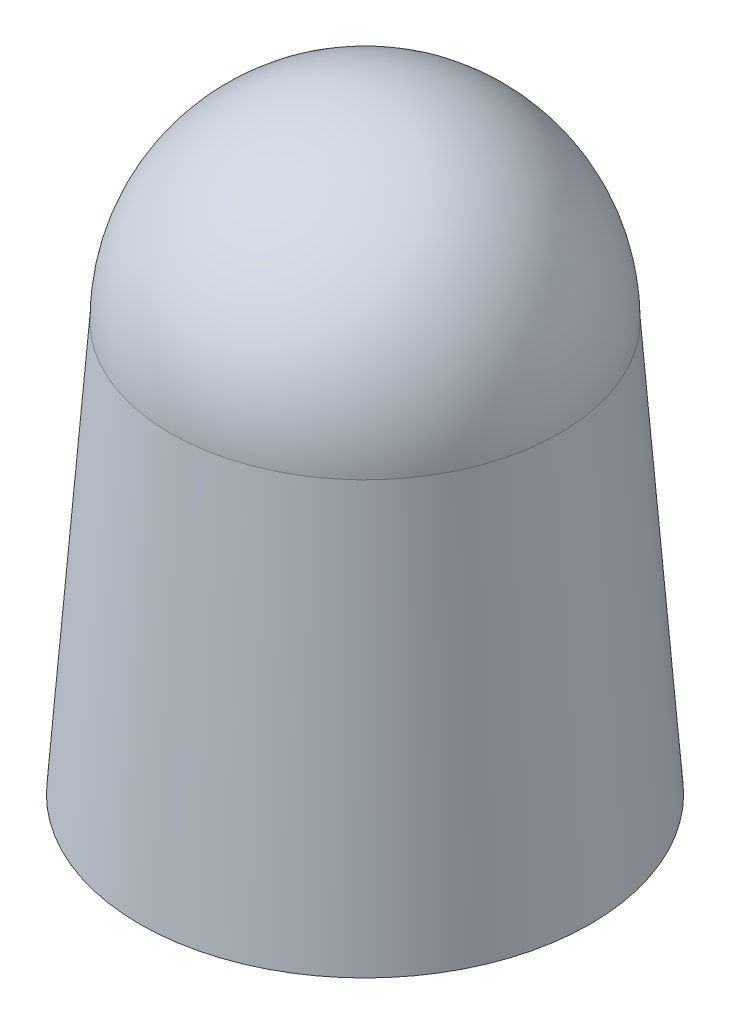
ISO-10303-21;
HEADER;
FILE_DESCRIPTION(('STEP AP214'),'2;1');
FILE_NAME('part.step','',(''),(''),'','','');
FILE_SCHEMA(('AUTOMOTIVE_DESIGN { 1 0 10303 214 1 1 1 1 }'));
ENDSEC;
DATA;
#1=APPLICATION_CONTEXT('core data for automotive mechanical design processes');
#2=APPLICATION_PROTOCOL_DEFINITION('international standard','automotive_design',2000,#1);
#3=PRODUCT_CONTEXT('',#1,'mechanical');
#4=PRODUCT('Part','Part','',(#3));
#5=PRODUCT_RELATED_PRODUCT_CATEGORY('part','',(#4));
#6=PRODUCT_DEFINITION_FORMATION('','',#4);
#7=PRODUCT_DEFINITION_CONTEXT('part definition',#1,'design');
#8=PRODUCT_DEFINITION('design','',#6,#7);
#9=PRODUCT_DEFINITION_SHAPE('','',#8);
#10=(LENGTH_UNIT() NAMED_UNIT(*) SI_UNIT(.MILLI.,.METRE.));
#11=(NAMED_UNIT(*) PLANE_ANGLE_UNIT() SI_UNIT($,.RADIAN.));
#12=(NAMED_UNIT(*) SI_UNIT($,.STERADIAN.) SOLID_ANGLE_UNIT());
#13=UNCERTAINTY_MEASURE_WITH_UNIT(LENGTH_MEASURE(1.E-05),#10,'distance_accuracy_value','');
#14=(GEOMETRIC_REPRESENTATION_CONTEXT(3) GLOBAL_UNCERTAINTY_ASSIGNED_CONTEXT((#13)) GLOBAL_UNIT_ASSIGNED_CONTEXT((#10,
#11,#12)) REPRESENTATION_CONTEXT('',''));
#15=CARTESIAN_POINT('',(0.,0.,0.));
#16=DIRECTION('',(0.,0.,1.));
#17=DIRECTION('',(1.,0.,0.));
#18=AXIS2_PLACEMENT_3D('',#15,#16,#17);
#19=CARTESIAN_POINT('',(0.,0.4,0.));
#20=DIRECTION('',(0.,-1.,0.));
#21=DIRECTION('',(0.,0.,-1.));
#22=AXIS2_PLACEMENT_3D('',#19,#20,#21);
#23=CONICAL_SURFACE('',#22,10.5688765775974,0.0748598477107669);
#24=CARTESIAN_POINT('',(0.,19.6,0.));
#25=DIRECTION('',(0.,-1.,0.));
#26=DIRECTION('',(0.,0.,-1.));
#27=AXIS2_PLACEMENT_3D('',#24,#25,#26);
#28=CIRCLE('',#27,9.12887657759737);
#29=CARTESIAN_POINT('',(0.,19.6,-9.12887657759737));
#30=VERTEX_POINT('',#29);
#31=EDGE_CURVE('E71',#30,#30,#28,.T.);
#32=ORIENTED_EDGE('',*,*,#31,.F.);
#33=EDGE_LOOP('',(#32));
#34=FACE_BOUND('',#33,.T.);
#35=CARTESIAN_POINT('',(0.,0.5,0.));
#36=DIRECTION('',(0.,-1.,0.));
#37=DIRECTION('',(0.,0.,-1.));
#38=AXIS2_PLACEMENT_3D('',#35,#36,#37);
#39=CIRCLE('',#38,10.5613765775974);
#40=CARTESIAN_POINT('',(0.,0.5,-10.5613765775974));
#41=VERTEX_POINT('',#40);
#42=EDGE_CURVE('E58',#41,#41,#39,.F.);
#43=ORIENTED_EDGE('',*,*,#42,.F.);
#44=EDGE_LOOP('',(#43));
#45=FACE_BOUND('',#44,.T.);
#46=ADVANCED_FACE('F49',(#34,#45),#23,.F.);
#47=CARTESIAN_POINT('',(0.,0.,0.));
#48=DIRECTION('',(0.,1.,0.));
#49=DIRECTION('',(0.,0.,1.));
#50=AXIS2_PLACEMENT_3D('',#47,#48,#49);
#51=CYLINDRICAL_SURFACE('',#50,8.5);
#52=CARTESIAN_POINT('',(0.,19.6,0.));
#53=DIRECTION('',(0.,-1.,0.));
#54=DIRECTION('',(0.,0.,-1.));
#55=AXIS2_PLACEMENT_3D('',#52,#53,#54);
#56=CIRCLE('',#55,8.5);
#57=CARTESIAN_POINT('',(0.,19.6,-8.5));
#58=VERTEX_POINT('',#57);
#59=EDGE_CURVE('E65',#58,#58,#56,.T.);
#60=ORIENTED_EDGE('',*,*,#59,.T.);
#61=EDGE_LOOP('',(#60));
#62=FACE_BOUND('',#61,.T.);
#63=CARTESIAN_POINT('',(0.,20.,0.));
#64=DIRECTION('',(0.,1.,0.));
#65=DIRECTION('',(-1.,0.,0.));
#66=AXIS2_PLACEMENT_3D('',#63,#64,#65);
#67=CIRCLE('',#66,8.5);
#68=CARTESIAN_POINT('',(-8.5,19.9999999999999,0.));
#69=VERTEX_POINT('',#68);
#70=EDGE_CURVE('E70',#69,#69,#67,.F.);
#71=ORIENTED_EDGE('',*,*,#70,.F.);
#72=EDGE_LOOP('',(#71));
#73=FACE_BOUND('',#72,.T.);
#74=ADVANCED_FACE('F51',(#62,#73),#51,.F.);
#75=CARTESIAN_POINT('',(0.,0.,0.));
#76=DIRECTION('',(0.,-1.,0.));
#77=DIRECTION('',(0.,0.,-1.));
#78=AXIS2_PLACEMENT_3D('',#75,#76,#77);
#79=CONICAL_SURFACE('',#78,11.,0.0748598477107669);
#80=CARTESIAN_POINT('',(0.,20.,0.));
#81=DIRECTION('',(0.,-1.,0.));
#82=DIRECTION('',(0.,0.,-1.));
#83=AXIS2_PLACEMENT_3D('',#80,#81,#82);
#84=CIRCLE('',#83,9.5);
#85=CARTESIAN_POINT('',(0.,20.,-9.5));
#86=VERTEX_POINT('',#85);
#87=EDGE_CURVE('E81',#86,#86,#84,.T.);
#88=ORIENTED_EDGE('',*,*,#87,.T.);
#89=EDGE_LOOP('',(#88));
#90=FACE_BOUND('',#89,.T.);
#91=CARTESIAN_POINT('',(0.,0.,0.));
#92=DIRECTION('',(0.,-1.,0.));
#93=DIRECTION('',(0.,0.,-1.));
#94=AXIS2_PLACEMENT_3D('',#91,#92,#93);
#95=CIRCLE('',#94,11.);
#96=CARTESIAN_POINT('',(0.,0.,-11.));
#97=VERTEX_POINT('',#96);
#98=EDGE_CURVE('E69',#97,#97,#95,.T.);
#99=ORIENTED_EDGE('',*,*,#98,.F.);
#100=EDGE_LOOP('',(#99));
#101=FACE_BOUND('',#100,.T.);
#102=ADVANCED_FACE('F86',(#90,#101),#79,.T.);
#103=CARTESIAN_POINT('',(0.,0.,0.));
#104=DIRECTION('',(0.,-1.,0.));
#105=DIRECTION('',(0.,0.,-1.));
#106=AXIS2_PLACEMENT_3D('',#103,#104,#105);
#107=PLANE('',#106);
#108=CARTESIAN_POINT('',(0.,0.,0.));
#109=DIRECTION('',(0.,-1.,0.));
#110=DIRECTION('',(0.,0.,-1.));
#111=AXIS2_PLACEMENT_3D('',#108,#109,#110);
#112=CIRCLE('',#111,10.8024428820539);
#113=CARTESIAN_POINT('',(0.,0.,-10.8024428820539));
#114=VERTEX_POINT('',#113);
#115=EDGE_CURVE('E11',#114,#114,#112,.T.);
#116=ORIENTED_EDGE('',*,*,#115,.F.);
#117=EDGE_LOOP('',(#116));
#118=FACE_BOUND('',#117,.T.);
#119=ORIENTED_EDGE('',*,*,#98,.T.);
#120=EDGE_LOOP('',(#119));
#121=FACE_BOUND('',#120,.T.);
#122=ADVANCED_FACE('F116',(#118,#121),#107,.T.);
#123=CARTESIAN_POINT('',(9.12887657759737,19.6,0.));
#124=DIRECTION('',(0.,1.,0.));
#125=DIRECTION('',(0.,0.,1.));
#126=AXIS2_PLACEMENT_3D('',#123,#124,#125);
#127=PLANE('',#126);
#128=ORIENTED_EDGE('',*,*,#59,.F.);
#129=EDGE_LOOP('',(#128));
#130=FACE_BOUND('',#129,.T.);
#131=ORIENTED_EDGE('',*,*,#31,.T.);
#132=EDGE_LOOP('',(#131));
#133=FACE_BOUND('',#132,.T.);
#134=ADVANCED_FACE('F114',(#130,#133),#127,.F.);
#135=CARTESIAN_POINT('',(0.,0.5,0.));
#136=DIRECTION('',(0.,-1.,0.));
#137=DIRECTION('',(0.,0.,-1.));
#138=AXIS2_PLACEMENT_3D('',#135,#136,#137);
#139=PLANE('',#138);
#140=CARTESIAN_POINT('',(0.,0.5,0.));
#141=DIRECTION('',(0.,-1.,0.));
#142=DIRECTION('',(0.,0.,-1.));
#143=AXIS2_PLACEMENT_3D('',#140,#141,#142);
#144=CIRCLE('',#143,10.8024428820539);
#145=CARTESIAN_POINT('',(0.,0.5,-10.8024428820539));
#146=VERTEX_POINT('',#145);
#147=EDGE_CURVE('E53',#146,#146,#144,.T.);
#148=ORIENTED_EDGE('',*,*,#147,.T.);
#149=EDGE_LOOP('',(#148));
#150=FACE_BOUND('',#149,.T.);
#151=ORIENTED_EDGE('',*,*,#42,.T.);
#152=EDGE_LOOP('',(#151));
#153=FACE_BOUND('',#152,.T.);
#154=ADVANCED_FACE('F100',(#150,#153),#139,.T.);
#155=CARTESIAN_POINT('',(0.,0.5,0.));
#156=DIRECTION('',(0.,-1.,0.));
#157=DIRECTION('',(0.,0.,-1.));
#158=AXIS2_PLACEMENT_3D('',#155,#156,#157);
#159=CYLINDRICAL_SURFACE('',#158,10.8024428820539);
#160=ORIENTED_EDGE('',*,*,#147,.F.);
#161=EDGE_LOOP('',(#160));
#162=FACE_BOUND('',#161,.T.);
#163=ORIENTED_EDGE('',*,*,#115,.T.);
#164=EDGE_LOOP('',(#163));
#165=FACE_BOUND('',#164,.T.);
#166=ADVANCED_FACE('F92',(#162,#165),#159,.F.);
#167=CARTESIAN_POINT('',(0.,20.,0.));
#168=DIRECTION('',(0.,0.,-1.));
#169=DIRECTION('',(1.,0.,0.));
#170=AXIS2_PLACEMENT_3D('',#167,#168,#169);
#171=SPHERICAL_SURFACE('',#170,9.5);
#172=CARTESIAN_POINT('',(0.,20.,0.));
#173=DIRECTION('',(0.,-1.,0.));
#174=DIRECTION('',(0.,0.,-1.));
#175=AXIS2_PLACEMENT_3D('',#172,#173,#174);
#176=SPHERICAL_SURFACE('',#175,9.5);
#177=ORIENTED_EDGE('',*,*,#87,.F.);
#178=EDGE_LOOP('',(#177));
#179=FACE_BOUND('',#178,.T.);
#180=ADVANCED_FACE('F89',(#179),#176,.T.);
#181=CARTESIAN_POINT('',(0.,20.,0.));
#182=DIRECTION('',(0.,1.,0.));
#183=DIRECTION('',(0.,0.,-1.));
#184=AXIS2_PLACEMENT_3D('',#181,#182,#183);
#185=PLANE('',#184);
#186=ORIENTED_EDGE('',*,*,#70,.T.);
#187=EDGE_LOOP('',(#186));
#188=FACE_BOUND('',#187,.T.);
#189=ADVANCED_FACE('F91',(#188),#185,.F.);
#190=CLOSED_SHELL('',(#46,#74,#102,#122,#134,#154,#166,#180,#189));
#191=MANIFOLD_SOLID_BREP('B2',#190);
#192=CARTESIAN_POINT('',(0.,0.,0.));
#193=DIRECTION('',(0.,-1.,0.));
#194=DIRECTION('',(0.,0.,-1.));
#195=AXIS2_PLACEMENT_3D('',#192,#193,#194);
#196=PLANE('',#195);
#197=CARTESIAN_POINT('',(0.,0.,0.));
#198=DIRECTION('',(0.,1.,0.));
#199=DIRECTION('',(0.,0.,1.));
#200=AXIS2_PLACEMENT_3D('',#197,#198,#199);
#201=CIRCLE('',#200,8.5);
#202=CARTESIAN_POINT('',(0.,0.,8.5));
#203=VERTEX_POINT('',#202);
#204=EDGE_CURVE('E48',#203,#203,#201,.T.);
#205=ORIENTED_EDGE('',*,*,#204,.T.);
#206=EDGE_LOOP('',(#205));
#207=FACE_BOUND('',#206,.T.);
#208=CARTESIAN_POINT('',(0.,0.,0.));
#209=DIRECTION('',(0.,-1.,0.));
#210=DIRECTION('',(0.,0.,-1.));
#211=AXIS2_PLACEMENT_3D('',#208,#209,#210);
#212=CIRCLE('',#211,8.70756274589039);
#213=CARTESIAN_POINT('',(0.,0.,-8.70756274589039));
#214=VERTEX_POINT('',#213);
#215=EDGE_CURVE('E222',#214,#214,#212,.T.);
#216=ORIENTED_EDGE('',*,*,#215,.T.);
#217=EDGE_LOOP('',(#216));
#218=FACE_BOUND('',#217,.T.);
#219=ADVANCED_FACE('F209',(#207,#218),#196,.T.);
#220=CARTESIAN_POINT('',(0.,0.,0.));
#221=DIRECTION('',(0.,1.,0.));
#222=DIRECTION('',(0.,0.,1.));
#223=AXIS2_PLACEMENT_3D('',#220,#221,#222);
#224=CYLINDRICAL_SURFACE('',#223,8.5);
#225=CARTESIAN_POINT('',(0.,0.4,0.));
#226=DIRECTION('',(0.,-1.,0.));
#227=DIRECTION('',(0.,0.,-1.));
#228=AXIS2_PLACEMENT_3D('',#225,#226,#227);
#229=CIRCLE('',#228,8.5);
#230=CARTESIAN_POINT('',(0.,0.4,-8.5));
#231=VERTEX_POINT('',#230);
#232=EDGE_CURVE('E216',#231,#231,#229,.T.);
#233=ORIENTED_EDGE('',*,*,#232,.F.);
#234=EDGE_LOOP('',(#233));
#235=FACE_BOUND('',#234,.T.);
#236=ORIENTED_EDGE('',*,*,#204,.F.);
#237=EDGE_LOOP('',(#236));
#238=FACE_BOUND('',#237,.T.);
#239=ADVANCED_FACE('F233',(#235,#238),#224,.F.);
#240=CARTESIAN_POINT('',(8.5,0.4,0.));
#241=DIRECTION('',(0.,-1.,0.));
#242=DIRECTION('',(0.,0.,-1.));
#243=AXIS2_PLACEMENT_3D('',#240,#241,#242);
#244=PLANE('',#243);
#245=ORIENTED_EDGE('',*,*,#232,.T.);
#246=EDGE_LOOP('',(#245));
#247=FACE_BOUND('',#246,.T.);
#248=CARTESIAN_POINT('',(0.,0.4,0.));
#249=DIRECTION('',(0.,-1.,0.));
#250=DIRECTION('',(0.,0.,-1.));
#251=AXIS2_PLACEMENT_3D('',#248,#249,#250);
#252=CIRCLE('',#251,8.70756274589039);
#253=CARTESIAN_POINT('',(0.,0.4,-8.70756274589039));
#254=VERTEX_POINT('',#253);
#255=EDGE_CURVE('E212',#254,#254,#252,.T.);
#256=ORIENTED_EDGE('',*,*,#255,.F.);
#257=EDGE_LOOP('',(#256));
#258=FACE_BOUND('',#257,.T.);
#259=ADVANCED_FACE('F231',(#247,#258),#244,.F.);
#260=CARTESIAN_POINT('',(0.,0.5,0.));
#261=DIRECTION('',(0.,-1.,0.));
#262=DIRECTION('',(0.,0.,-1.));
#263=AXIS2_PLACEMENT_3D('',#260,#261,#262);
#264=CYLINDRICAL_SURFACE('',#263,8.70756274589039);
#265=ORIENTED_EDGE('',*,*,#215,.F.);
#266=EDGE_LOOP('',(#265));
#267=FACE_BOUND('',#266,.T.);
#268=ORIENTED_EDGE('',*,*,#255,.T.);
#269=EDGE_LOOP('',(#268));
#270=FACE_BOUND('',#269,.T.);
#271=ADVANCED_FACE('F229',(#267,#270),#264,.T.);
#272=CLOSED_SHELL('',(#219,#239,#259,#271));
#273=MANIFOLD_SOLID_BREP('B6',#272);
#274=ADVANCED_BREP_SHAPE_REPRESENTATION('',(#18,#191,#273),#14);
#275=SHAPE_DEFINITION_REPRESENTATION(#9,#274);
ENDSEC;
END-ISO-10303-21;
